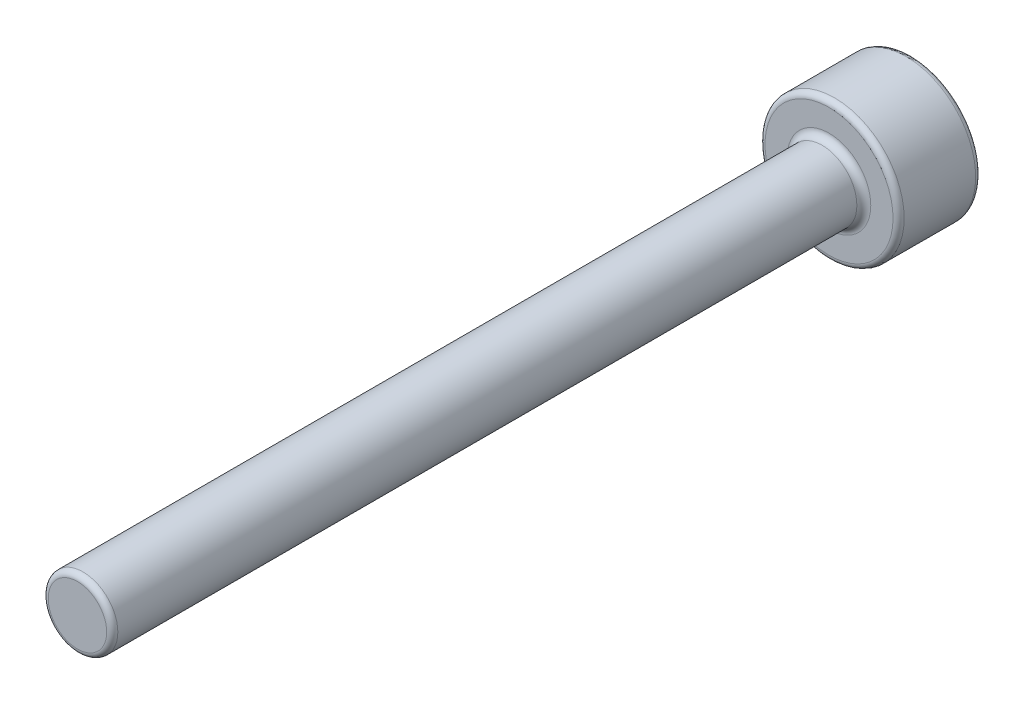
ISO-10303-21;
HEADER;
FILE_DESCRIPTION(('STEP AP214'),'2;1');
FILE_NAME('part.step','',(''),(''),'','','');
FILE_SCHEMA(('AUTOMOTIVE_DESIGN { 1 0 10303 214 1 1 1 1 }'));
ENDSEC;
DATA;
#1=APPLICATION_CONTEXT('core data for automotive mechanical design processes');
#2=APPLICATION_PROTOCOL_DEFINITION('international standard','automotive_design',2000,#1);
#3=PRODUCT_CONTEXT('',#1,'mechanical');
#4=PRODUCT('Part','Part','',(#3));
#5=PRODUCT_RELATED_PRODUCT_CATEGORY('part','',(#4));
#6=PRODUCT_DEFINITION_FORMATION('','',#4);
#7=PRODUCT_DEFINITION_CONTEXT('part definition',#1,'design');
#8=PRODUCT_DEFINITION('design','',#6,#7);
#9=PRODUCT_DEFINITION_SHAPE('','',#8);
#10=(LENGTH_UNIT() NAMED_UNIT(*) SI_UNIT(.MILLI.,.METRE.));
#11=(NAMED_UNIT(*) PLANE_ANGLE_UNIT() SI_UNIT($,.RADIAN.));
#12=(NAMED_UNIT(*) SI_UNIT($,.STERADIAN.) SOLID_ANGLE_UNIT());
#13=UNCERTAINTY_MEASURE_WITH_UNIT(LENGTH_MEASURE(1.E-05),#10,'distance_accuracy_value','');
#14=(GEOMETRIC_REPRESENTATION_CONTEXT(3) GLOBAL_UNCERTAINTY_ASSIGNED_CONTEXT((#13)) GLOBAL_UNIT_ASSIGNED_CONTEXT((#10,
#11,#12)) REPRESENTATION_CONTEXT('',''));
#15=CARTESIAN_POINT('',(0.,0.,0.));
#16=DIRECTION('',(0.,0.,1.));
#17=DIRECTION('',(1.,0.,0.));
#18=AXIS2_PLACEMENT_3D('',#15,#16,#17);
#19=CARTESIAN_POINT('',(0.,0.,6.));
#20=DIRECTION('',(0.,0.,1.));
#21=DIRECTION('',(1.,0.,0.));
#22=AXIS2_PLACEMENT_3D('',#19,#20,#21);
#23=PLANE('',#22);
#24=CARTESIAN_POINT('',(0.,0.,6.));
#25=DIRECTION('',(0.,0.,1.));
#26=DIRECTION('',(1.,0.,0.));
#27=AXIS2_PLACEMENT_3D('',#24,#25,#26);
#28=CIRCLE('',#27,4.6);
#29=CARTESIAN_POINT('',(4.6,0.,6.));
#30=VERTEX_POINT('',#29);
#31=EDGE_CURVE('E182',#30,#30,#28,.T.);
#32=ORIENTED_EDGE('',*,*,#31,.T.);
#33=EDGE_LOOP('',(#32));
#34=FACE_BOUND('',#33,.T.);
#35=CARTESIAN_POINT('',(0.,0.,6.));
#36=DIRECTION('',(0.,0.,1.));
#37=DIRECTION('',(1.,0.,0.));
#38=AXIS2_PLACEMENT_3D('',#35,#36,#37);
#39=CIRCLE('',#38,3.);
#40=CARTESIAN_POINT('',(3.,0.,6.));
#41=VERTEX_POINT('',#40);
#42=EDGE_CURVE('E147',#41,#41,#39,.F.);
#43=ORIENTED_EDGE('',*,*,#42,.T.);
#44=EDGE_LOOP('',(#43));
#45=FACE_BOUND('',#44,.T.);
#46=ADVANCED_FACE('F36',(#34,#45),#23,.T.);
#47=CARTESIAN_POINT('',(0.,0.,6.));
#48=DIRECTION('',(0.,0.,-1.));
#49=DIRECTION('',(-1.,0.,0.));
#50=AXIS2_PLACEMENT_3D('',#47,#48,#49);
#51=CYLINDRICAL_SURFACE('',#50,5.);
#52=CARTESIAN_POINT('',(0.,0.,5.6));
#53=DIRECTION('',(0.,0.,1.));
#54=DIRECTION('',(1.,0.,0.));
#55=AXIS2_PLACEMENT_3D('',#52,#53,#54);
#56=CIRCLE('',#55,5.);
#57=CARTESIAN_POINT('',(5.,0.,5.6));
#58=VERTEX_POINT('',#57);
#59=EDGE_CURVE('E188',#58,#58,#56,.F.);
#60=ORIENTED_EDGE('',*,*,#59,.T.);
#61=EDGE_LOOP('',(#60));
#62=FACE_BOUND('',#61,.T.);
#63=CARTESIAN_POINT('',(0.,0.,0.461880215351701));
#64=DIRECTION('',(0.,0.,-1.));
#65=DIRECTION('',(-1.,0.,0.));
#66=AXIS2_PLACEMENT_3D('',#63,#64,#65);
#67=CIRCLE('',#66,5.);
#68=CARTESIAN_POINT('',(-5.,0.,0.461880215351701));
#69=VERTEX_POINT('',#68);
#70=EDGE_CURVE('E185',#69,#69,#67,.F.);
#71=ORIENTED_EDGE('',*,*,#70,.T.);
#72=EDGE_LOOP('',(#71));
#73=FACE_BOUND('',#72,.T.);
#74=ADVANCED_FACE('F327',(#62,#73),#51,.T.);
#75=CARTESIAN_POINT('',(0.,0.,0.));
#76=DIRECTION('',(0.,0.,1.));
#77=DIRECTION('',(1.,0.,0.));
#78=AXIS2_PLACEMENT_3D('',#75,#76,#77);
#79=PLANE('',#78);
#80=DIRECTION('',(0.866025403784439,-0.5,0.));
#81=VECTOR('',#80,1.);
#82=CARTESIAN_POINT('',(1.45,2.51147367097487,0.));
#83=LINE('',#82,#81);
#84=CARTESIAN_POINT('',(2.9,1.67431578064992,0.));
#85=VERTEX_POINT('',#84);
#86=CARTESIAN_POINT('',(0.,3.34863156129983,0.));
#87=VERTEX_POINT('',#86);
#88=EDGE_CURVE('E53',#85,#87,#83,.F.);
#89=ORIENTED_EDGE('',*,*,#88,.T.);
#90=DIRECTION('',(0.866025403784439,0.5,0.));
#91=VECTOR('',#90,1.);
#92=CARTESIAN_POINT('',(-1.45,2.51147367097487,0.));
#93=LINE('',#92,#91);
#94=CARTESIAN_POINT('',(-2.9,1.67431578064992,0.));
#95=VERTEX_POINT('',#94);
#96=EDGE_CURVE('E208',#87,#95,#93,.F.);
#97=ORIENTED_EDGE('',*,*,#96,.T.);
#98=DIRECTION('',(0.,1.,0.));
#99=VECTOR('',#98,1.);
#100=CARTESIAN_POINT('',(-2.9,0.,0.));
#101=LINE('',#100,#99);
#102=CARTESIAN_POINT('',(-2.9,-1.67431578064992,0.));
#103=VERTEX_POINT('',#102);
#104=EDGE_CURVE('E200',#95,#103,#101,.F.);
#105=ORIENTED_EDGE('',*,*,#104,.T.);
#106=DIRECTION('',(-0.866025403784439,0.5,0.));
#107=VECTOR('',#106,1.);
#108=CARTESIAN_POINT('',(-1.45,-2.51147367097487,0.));
#109=LINE('',#108,#107);
#110=CARTESIAN_POINT('',(0.,-3.34863156129983,0.));
#111=VERTEX_POINT('',#110);
#112=EDGE_CURVE('E202',#103,#111,#109,.F.);
#113=ORIENTED_EDGE('',*,*,#112,.T.);
#114=DIRECTION('',(-0.866025403784439,-0.5,0.));
#115=VECTOR('',#114,1.);
#116=CARTESIAN_POINT('',(1.45,-2.51147367097487,0.));
#117=LINE('',#116,#115);
#118=CARTESIAN_POINT('',(2.9,-1.67431578064991,0.));
#119=VERTEX_POINT('',#118);
#120=EDGE_CURVE('E204',#111,#119,#117,.F.);
#121=ORIENTED_EDGE('',*,*,#120,.T.);
#122=DIRECTION('',(0.,-1.,0.));
#123=VECTOR('',#122,1.);
#124=CARTESIAN_POINT('',(2.9,0.,0.));
#125=LINE('',#124,#123);
#126=EDGE_CURVE('E58',#119,#85,#125,.F.);
#127=ORIENTED_EDGE('',*,*,#126,.T.);
#128=EDGE_LOOP('',(#89,#97,#105,#113,#121,#127));
#129=FACE_BOUND('',#128,.T.);
#130=CARTESIAN_POINT('',(0.,0.,0.));
#131=DIRECTION('',(0.,0.,1.));
#132=DIRECTION('',(1.,0.,0.));
#133=AXIS2_PLACEMENT_3D('',#130,#131,#132);
#134=CIRCLE('',#133,4.49282032302755);
#135=CARTESIAN_POINT('',(4.49282032302755,0.,0.));
#136=VERTEX_POINT('',#135);
#137=EDGE_CURVE('E197',#136,#136,#134,.F.);
#138=ORIENTED_EDGE('',*,*,#137,.T.);
#139=EDGE_LOOP('',(#138));
#140=FACE_BOUND('',#139,.T.);
#141=ADVANCED_FACE('F249',(#129,#140),#79,.F.);
#142=CARTESIAN_POINT('',(0.,0.,60.));
#143=DIRECTION('',(0.,0.,-1.));
#144=DIRECTION('',(-1.,0.,0.));
#145=AXIS2_PLACEMENT_3D('',#142,#143,#144);
#146=CYLINDRICAL_SURFACE('',#145,2.5);
#147=CARTESIAN_POINT('',(0.,0.,59.6));
#148=DIRECTION('',(0.,0.,1.));
#149=DIRECTION('',(1.,0.,0.));
#150=AXIS2_PLACEMENT_3D('',#147,#148,#149);
#151=CIRCLE('',#150,2.5);
#152=CARTESIAN_POINT('',(2.5,0.,59.6));
#153=VERTEX_POINT('',#152);
#154=EDGE_CURVE('E11',#153,#153,#151,.F.);
#155=ORIENTED_EDGE('',*,*,#154,.T.);
#156=EDGE_LOOP('',(#155));
#157=FACE_BOUND('',#156,.T.);
#158=CARTESIAN_POINT('',(0.,0.,6.5));
#159=DIRECTION('',(0.,0.,1.));
#160=DIRECTION('',(1.,0.,0.));
#161=AXIS2_PLACEMENT_3D('',#158,#159,#160);
#162=CIRCLE('',#161,2.5);
#163=CARTESIAN_POINT('',(2.5,0.,6.5));
#164=VERTEX_POINT('',#163);
#165=EDGE_CURVE('E277',#164,#164,#162,.T.);
#166=ORIENTED_EDGE('',*,*,#165,.T.);
#167=EDGE_LOOP('',(#166));
#168=FACE_BOUND('',#167,.T.);
#169=ADVANCED_FACE('F338',(#157,#168),#146,.T.);
#170=CARTESIAN_POINT('',(0.,0.,60.));
#171=DIRECTION('',(0.,0.,1.));
#172=DIRECTION('',(1.,0.,0.));
#173=AXIS2_PLACEMENT_3D('',#170,#171,#172);
#174=PLANE('',#173);
#175=CARTESIAN_POINT('',(0.,0.,60.));
#176=DIRECTION('',(0.,0.,1.));
#177=DIRECTION('',(1.,0.,0.));
#178=AXIS2_PLACEMENT_3D('',#175,#176,#177);
#179=CIRCLE('',#178,2.1);
#180=CARTESIAN_POINT('',(2.1,0.,60.));
#181=VERTEX_POINT('',#180);
#182=EDGE_CURVE('E45',#181,#181,#179,.T.);
#183=ORIENTED_EDGE('',*,*,#182,.T.);
#184=EDGE_LOOP('',(#183));
#185=FACE_BOUND('',#184,.T.);
#186=ADVANCED_FACE('F426',(#185),#174,.T.);
#187=CARTESIAN_POINT('',(0.,-2.88675134594813,3.));
#188=DIRECTION('',(-0.5,-0.866025403784439,0.));
#189=DIRECTION('',(0.866025403784439,-0.5,0.));
#190=AXIS2_PLACEMENT_3D('',#187,#188,#189);
#191=PLANE('',#190);
#192=DIRECTION('',(0.,0.,-1.));
#193=VECTOR('',#192,1.);
#194=CARTESIAN_POINT('',(-2.5,-1.44337567297407,3.));
#195=LINE('',#194,#193);
#196=CARTESIAN_POINT('',(-2.5,-1.44337567297407,2.6));
#197=VERTEX_POINT('',#196);
#198=CARTESIAN_POINT('',(-2.5,-1.44337567297407,0.4));
#199=VERTEX_POINT('',#198);
#200=EDGE_CURVE('E223',#197,#199,#195,.T.);
#201=ORIENTED_EDGE('',*,*,#200,.F.);
#202=DIRECTION('',(-0.866025403784439,0.5,0.));
#203=VECTOR('',#202,1.);
#204=CARTESIAN_POINT('',(0.,-2.88675134594813,2.6));
#205=LINE('',#204,#203);
#206=CARTESIAN_POINT('',(0.,-2.88675134594813,2.6));
#207=VERTEX_POINT('',#206);
#208=EDGE_CURVE('E180',#197,#207,#205,.F.);
#209=ORIENTED_EDGE('',*,*,#208,.T.);
#210=DIRECTION('',(0.,0.,-1.));
#211=VECTOR('',#210,1.);
#212=CARTESIAN_POINT('',(0.,-2.88675134594813,3.));
#213=LINE('',#212,#211);
#214=CARTESIAN_POINT('',(0.,-2.88675134594813,0.4));
#215=VERTEX_POINT('',#214);
#216=EDGE_CURVE('E280',#207,#215,#213,.T.);
#217=ORIENTED_EDGE('',*,*,#216,.T.);
#218=DIRECTION('',(-0.866025403784439,0.5,0.));
#219=VECTOR('',#218,1.);
#220=CARTESIAN_POINT('',(0.,-2.88675134594813,0.4));
#221=LINE('',#220,#219);
#222=EDGE_CURVE('E178',#215,#199,#221,.T.);
#223=ORIENTED_EDGE('',*,*,#222,.T.);
#224=EDGE_LOOP('',(#201,#209,#217,#223));
#225=FACE_BOUND('',#224,.T.);
#226=ADVANCED_FACE('F428',(#225),#191,.F.);
#227=CARTESIAN_POINT('',(2.5,-1.44337567297406,3.));
#228=DIRECTION('',(0.5,-0.866025403784438,0.));
#229=DIRECTION('',(0.866025403784439,0.5,0.));
#230=AXIS2_PLACEMENT_3D('',#227,#228,#229);
#231=PLANE('',#230);
#232=ORIENTED_EDGE('',*,*,#216,.F.);
#233=DIRECTION('',(-0.866025403784439,-0.5,0.));
#234=VECTOR('',#233,1.);
#235=CARTESIAN_POINT('',(2.5,-1.44337567297406,2.6));
#236=LINE('',#235,#234);
#237=CARTESIAN_POINT('',(2.5,-1.44337567297406,2.6));
#238=VERTEX_POINT('',#237);
#239=EDGE_CURVE('E134',#207,#238,#236,.F.);
#240=ORIENTED_EDGE('',*,*,#239,.T.);
#241=DIRECTION('',(0.,0.,-1.));
#242=VECTOR('',#241,1.);
#243=CARTESIAN_POINT('',(2.5,-1.44337567297406,3.));
#244=LINE('',#243,#242);
#245=CARTESIAN_POINT('',(2.5,-1.44337567297406,0.4));
#246=VERTEX_POINT('',#245);
#247=EDGE_CURVE('E303',#238,#246,#244,.T.);
#248=ORIENTED_EDGE('',*,*,#247,.T.);
#249=DIRECTION('',(-0.866025403784439,-0.5,0.));
#250=VECTOR('',#249,1.);
#251=CARTESIAN_POINT('',(2.5,-1.44337567297406,0.4));
#252=LINE('',#251,#250);
#253=EDGE_CURVE('E153',#246,#215,#252,.T.);
#254=ORIENTED_EDGE('',*,*,#253,.T.);
#255=EDGE_LOOP('',(#232,#240,#248,#254));
#256=FACE_BOUND('',#255,.T.);
#257=ADVANCED_FACE('F302',(#256),#231,.F.);
#258=CARTESIAN_POINT('',(2.5,1.44337567297407,3.));
#259=DIRECTION('',(1.,0.,0.));
#260=DIRECTION('',(0.,0.,-1.));
#261=AXIS2_PLACEMENT_3D('',#258,#259,#260);
#262=PLANE('',#261);
#263=ORIENTED_EDGE('',*,*,#247,.F.);
#264=DIRECTION('',(0.,-1.,0.));
#265=VECTOR('',#264,1.);
#266=CARTESIAN_POINT('',(2.5,1.44337567297407,2.6));
#267=LINE('',#266,#265);
#268=CARTESIAN_POINT('',(2.5,1.44337567297407,2.6));
#269=VERTEX_POINT('',#268);
#270=EDGE_CURVE('E163',#238,#269,#267,.F.);
#271=ORIENTED_EDGE('',*,*,#270,.T.);
#272=DIRECTION('',(0.,0.,-1.));
#273=VECTOR('',#272,1.);
#274=CARTESIAN_POINT('',(2.5,1.44337567297407,3.));
#275=LINE('',#274,#273);
#276=CARTESIAN_POINT('',(2.5,1.44337567297407,0.4));
#277=VERTEX_POINT('',#276);
#278=EDGE_CURVE('E272',#269,#277,#275,.T.);
#279=ORIENTED_EDGE('',*,*,#278,.T.);
#280=DIRECTION('',(0.,-1.,0.));
#281=VECTOR('',#280,1.);
#282=CARTESIAN_POINT('',(2.5,1.44337567297407,0.4));
#283=LINE('',#282,#281);
#284=EDGE_CURVE('E161',#277,#246,#283,.T.);
#285=ORIENTED_EDGE('',*,*,#284,.T.);
#286=EDGE_LOOP('',(#263,#271,#279,#285));
#287=FACE_BOUND('',#286,.T.);
#288=ADVANCED_FACE('F305',(#287),#262,.F.);
#289=CARTESIAN_POINT('',(0.,2.88675134594813,3.));
#290=DIRECTION('',(0.5,0.866025403784439,0.));
#291=DIRECTION('',(-0.866025403784439,0.5,0.));
#292=AXIS2_PLACEMENT_3D('',#289,#290,#291);
#293=PLANE('',#292);
#294=ORIENTED_EDGE('',*,*,#278,.F.);
#295=DIRECTION('',(0.866025403784439,-0.5,0.));
#296=VECTOR('',#295,1.);
#297=CARTESIAN_POINT('',(0.,2.88675134594813,2.6));
#298=LINE('',#297,#296);
#299=CARTESIAN_POINT('',(0.,2.88675134594813,2.6));
#300=VERTEX_POINT('',#299);
#301=EDGE_CURVE('E167',#269,#300,#298,.F.);
#302=ORIENTED_EDGE('',*,*,#301,.T.);
#303=DIRECTION('',(0.,0.,-1.));
#304=VECTOR('',#303,1.);
#305=CARTESIAN_POINT('',(0.,2.88675134594813,3.));
#306=LINE('',#305,#304);
#307=CARTESIAN_POINT('',(0.,2.88675134594813,0.4));
#308=VERTEX_POINT('',#307);
#309=EDGE_CURVE('E270',#300,#308,#306,.T.);
#310=ORIENTED_EDGE('',*,*,#309,.T.);
#311=DIRECTION('',(0.866025403784439,-0.5,0.));
#312=VECTOR('',#311,1.);
#313=CARTESIAN_POINT('',(0.,2.88675134594813,0.4));
#314=LINE('',#313,#312);
#315=EDGE_CURVE('E165',#308,#277,#314,.T.);
#316=ORIENTED_EDGE('',*,*,#315,.T.);
#317=EDGE_LOOP('',(#294,#302,#310,#316));
#318=FACE_BOUND('',#317,.T.);
#319=ADVANCED_FACE('F441',(#318),#293,.F.);
#320=CARTESIAN_POINT('',(-2.5,1.44337567297407,3.));
#321=DIRECTION('',(-0.5,0.866025403784439,0.));
#322=DIRECTION('',(-0.866025403784439,-0.5,0.));
#323=AXIS2_PLACEMENT_3D('',#320,#321,#322);
#324=PLANE('',#323);
#325=ORIENTED_EDGE('',*,*,#309,.F.);
#326=DIRECTION('',(0.866025403784439,0.5,0.));
#327=VECTOR('',#326,1.);
#328=CARTESIAN_POINT('',(-2.5,1.44337567297407,2.6));
#329=LINE('',#328,#327);
#330=CARTESIAN_POINT('',(-2.5,1.44337567297407,2.6));
#331=VERTEX_POINT('',#330);
#332=EDGE_CURVE('E172',#300,#331,#329,.F.);
#333=ORIENTED_EDGE('',*,*,#332,.T.);
#334=DIRECTION('',(0.,0.,-1.));
#335=VECTOR('',#334,1.);
#336=CARTESIAN_POINT('',(-2.5,1.44337567297407,3.));
#337=LINE('',#336,#335);
#338=CARTESIAN_POINT('',(-2.5,1.44337567297407,0.4));
#339=VERTEX_POINT('',#338);
#340=EDGE_CURVE('E262',#331,#339,#337,.T.);
#341=ORIENTED_EDGE('',*,*,#340,.T.);
#342=DIRECTION('',(0.866025403784439,0.5,0.));
#343=VECTOR('',#342,1.);
#344=CARTESIAN_POINT('',(-2.5,1.44337567297407,0.4));
#345=LINE('',#344,#343);
#346=EDGE_CURVE('E169',#339,#308,#345,.T.);
#347=ORIENTED_EDGE('',*,*,#346,.T.);
#348=EDGE_LOOP('',(#325,#333,#341,#347));
#349=FACE_BOUND('',#348,.T.);
#350=ADVANCED_FACE('F267',(#349),#324,.F.);
#351=CARTESIAN_POINT('',(-2.5,-1.44337567297407,3.));
#352=DIRECTION('',(-1.,0.,0.));
#353=DIRECTION('',(0.,0.,1.));
#354=AXIS2_PLACEMENT_3D('',#351,#352,#353);
#355=PLANE('',#354);
#356=ORIENTED_EDGE('',*,*,#340,.F.);
#357=DIRECTION('',(0.,1.,0.));
#358=VECTOR('',#357,1.);
#359=CARTESIAN_POINT('',(-2.5,-1.44337567297407,2.6));
#360=LINE('',#359,#358);
#361=EDGE_CURVE('E176',#331,#197,#360,.F.);
#362=ORIENTED_EDGE('',*,*,#361,.T.);
#363=ORIENTED_EDGE('',*,*,#200,.T.);
#364=DIRECTION('',(0.,1.,0.));
#365=VECTOR('',#364,1.);
#366=CARTESIAN_POINT('',(-2.5,-1.44337567297407,0.4));
#367=LINE('',#366,#365);
#368=EDGE_CURVE('E174',#199,#339,#367,.T.);
#369=ORIENTED_EDGE('',*,*,#368,.T.);
#370=EDGE_LOOP('',(#356,#362,#363,#369));
#371=FACE_BOUND('',#370,.T.);
#372=ADVANCED_FACE('F261',(#371),#355,.F.);
#373=CARTESIAN_POINT('',(-2.5,-1.44337567297407,3.));
#374=DIRECTION('',(0.,0.,-1.));
#375=DIRECTION('',(-1.,0.,0.));
#376=AXIS2_PLACEMENT_3D('',#373,#374,#375);
#377=PLANE('',#376);
#378=DIRECTION('',(0.,-1.,0.));
#379=VECTOR('',#378,1.);
#380=CARTESIAN_POINT('',(2.1,-1.44337567297407,3.));
#381=LINE('',#380,#379);
#382=CARTESIAN_POINT('',(2.1,1.21243556529822,3.));
#383=VERTEX_POINT('',#382);
#384=CARTESIAN_POINT('',(2.1,-1.21243556529821,3.));
#385=VERTEX_POINT('',#384);
#386=EDGE_CURVE('E151',#383,#385,#381,.T.);
#387=ORIENTED_EDGE('',*,*,#386,.T.);
#388=DIRECTION('',(-0.866025403784439,-0.5,0.));
#389=VECTOR('',#388,1.);
#390=CARTESIAN_POINT('',(-1.45,-3.26202902092139,3.));
#391=LINE('',#390,#389);
#392=CARTESIAN_POINT('',(0.,-2.42487113059643,3.));
#393=VERTEX_POINT('',#392);
#394=EDGE_CURVE('E132',#385,#393,#391,.T.);
#395=ORIENTED_EDGE('',*,*,#394,.T.);
#396=DIRECTION('',(-0.866025403784439,0.5,0.));
#397=VECTOR('',#396,1.);
#398=CARTESIAN_POINT('',(-2.3,-1.09696551146029,3.));
#399=LINE('',#398,#397);
#400=CARTESIAN_POINT('',(-2.1,-1.21243556529822,3.));
#401=VERTEX_POINT('',#400);
#402=EDGE_CURVE('E140',#393,#401,#399,.T.);
#403=ORIENTED_EDGE('',*,*,#402,.T.);
#404=DIRECTION('',(0.,1.,0.));
#405=VECTOR('',#404,1.);
#406=CARTESIAN_POINT('',(-2.1,-1.44337567297407,3.));
#407=LINE('',#406,#405);
#408=CARTESIAN_POINT('',(-2.1,1.21243556529822,3.));
#409=VERTEX_POINT('',#408);
#410=EDGE_CURVE('E146',#401,#409,#407,.T.);
#411=ORIENTED_EDGE('',*,*,#410,.T.);
#412=DIRECTION('',(0.866025403784439,0.5,0.));
#413=VECTOR('',#412,1.);
#414=CARTESIAN_POINT('',(-3.55,0.375277674973258,3.));
#415=LINE('',#414,#413);
#416=CARTESIAN_POINT('',(0.,2.42487113059643,3.));
#417=VERTEX_POINT('',#416);
#418=EDGE_CURVE('E284',#409,#417,#415,.T.);
#419=ORIENTED_EDGE('',*,*,#418,.T.);
#420=DIRECTION('',(0.866025403784439,-0.5,0.));
#421=VECTOR('',#420,1.);
#422=CARTESIAN_POINT('',(-0.199999999999999,2.54034118443435,3.));
#423=LINE('',#422,#421);
#424=EDGE_CURVE('E156',#417,#383,#423,.T.);
#425=ORIENTED_EDGE('',*,*,#424,.T.);
#426=EDGE_LOOP('',(#387,#395,#403,#411,#419,#425));
#427=FACE_BOUND('',#426,.T.);
#428=ADVANCED_FACE('F149',(#427),#377,.T.);
#429=CARTESIAN_POINT('',(0.,0.,0.23094010767585));
#430=DIRECTION('',(0.,0.,1.));
#431=DIRECTION('',(1.,0.,0.));
#432=AXIS2_PLACEMENT_3D('',#429,#430,#431);
#433=CONICAL_SURFACE('',#432,5.,1.0471975511966);
#434=CARTESIAN_POINT('',(0.,0.,0.115470053837925));
#435=DIRECTION('',(0.,0.,1.));
#436=DIRECTION('',(1.,0.,0.));
#437=AXIS2_PLACEMENT_3D('',#434,#435,#436);
#438=CIRCLE('',#437,4.8);
#439=CARTESIAN_POINT('',(4.8,0.,0.115470053837925));
#440=VERTEX_POINT('',#439);
#441=EDGE_CURVE('E194',#440,#440,#438,.F.);
#442=ORIENTED_EDGE('',*,*,#441,.T.);
#443=EDGE_LOOP('',(#442));
#444=FACE_BOUND('',#443,.T.);
#445=CARTESIAN_POINT('',(0.,0.,0.0535898384862229));
#446=DIRECTION('',(0.,0.,1.));
#447=DIRECTION('',(1.,0.,0.));
#448=AXIS2_PLACEMENT_3D('',#445,#446,#447);
#449=CIRCLE('',#448,4.69282032302755);
#450=CARTESIAN_POINT('',(4.69282032302755,0.,0.0535898384862229));
#451=VERTEX_POINT('',#450);
#452=EDGE_CURVE('E191',#451,#451,#449,.T.);
#453=ORIENTED_EDGE('',*,*,#452,.T.);
#454=EDGE_LOOP('',(#453));
#455=FACE_BOUND('',#454,.T.);
#456=ADVANCED_FACE('F342',(#444,#455),#433,.T.);
#457=CARTESIAN_POINT('',(0.,0.,6.5));
#458=DIRECTION('',(0.,0.,1.));
#459=DIRECTION('',(1.,0.,0.));
#460=AXIS2_PLACEMENT_3D('',#457,#458,#459);
#461=TOROIDAL_SURFACE('',#460,3.,0.5);
#462=ORIENTED_EDGE('',*,*,#42,.F.);
#463=EDGE_LOOP('',(#462));
#464=FACE_BOUND('',#463,.T.);
#465=ORIENTED_EDGE('',*,*,#165,.F.);
#466=EDGE_LOOP('',(#465));
#467=FACE_BOUND('',#466,.T.);
#468=ADVANCED_FACE('F345',(#464,#467),#461,.F.);
#469=CARTESIAN_POINT('',(-3.55,0.375277674973258,2.6));
#470=DIRECTION('',(0.866025403784439,0.5,0.));
#471=DIRECTION('',(-0.5,0.866025403784439,0.));
#472=AXIS2_PLACEMENT_3D('',#469,#470,#471);
#473=CYLINDRICAL_SURFACE('',#472,0.4);
#474=CARTESIAN_POINT('',(-2.1,1.21243556529822,2.6));
#475=DIRECTION('',(0.5,0.866025403784439,0.));
#476=DIRECTION('',(0.866025403784439,-0.5,0.));
#477=AXIS2_PLACEMENT_3D('',#474,#475,#476);
#478=ELLIPSE('',#477,0.461880215351701,0.4);
#479=EDGE_CURVE('E217',#331,#409,#478,.T.);
#480=ORIENTED_EDGE('',*,*,#479,.F.);
#481=ORIENTED_EDGE('',*,*,#332,.F.);
#482=CARTESIAN_POINT('',(0.,2.42487113059643,2.6));
#483=DIRECTION('',(1.,0.,0.));
#484=DIRECTION('',(0.,-1.,0.));
#485=AXIS2_PLACEMENT_3D('',#482,#483,#484);
#486=ELLIPSE('',#485,0.461880215351701,0.4);
#487=EDGE_CURVE('E220',#417,#300,#486,.F.);
#488=ORIENTED_EDGE('',*,*,#487,.F.);
#489=ORIENTED_EDGE('',*,*,#418,.F.);
#490=EDGE_LOOP('',(#480,#481,#488,#489));
#491=FACE_BOUND('',#490,.T.);
#492=ADVANCED_FACE('F349',(#491),#473,.F.);
#493=CARTESIAN_POINT('',(-0.199999999999999,2.54034118443435,2.6));
#494=DIRECTION('',(0.866025403784439,-0.5,0.));
#495=DIRECTION('',(0.5,0.866025403784439,0.));
#496=AXIS2_PLACEMENT_3D('',#493,#494,#495);
#497=CYLINDRICAL_SURFACE('',#496,0.4);
#498=ORIENTED_EDGE('',*,*,#487,.T.);
#499=ORIENTED_EDGE('',*,*,#301,.F.);
#500=CARTESIAN_POINT('',(2.1,1.21243556529821,2.6));
#501=DIRECTION('',(0.5,-0.866025403784439,0.));
#502=DIRECTION('',(-0.866025403784439,-0.5,0.));
#503=AXIS2_PLACEMENT_3D('',#500,#501,#502);
#504=ELLIPSE('',#503,0.461880215351701,0.4);
#505=EDGE_CURVE('E214',#383,#269,#504,.F.);
#506=ORIENTED_EDGE('',*,*,#505,.F.);
#507=ORIENTED_EDGE('',*,*,#424,.F.);
#508=EDGE_LOOP('',(#498,#499,#506,#507));
#509=FACE_BOUND('',#508,.T.);
#510=ADVANCED_FACE('F291',(#509),#497,.F.);
#511=CARTESIAN_POINT('',(-2.1,-1.44337567297407,2.6));
#512=DIRECTION('',(0.,1.,0.));
#513=DIRECTION('',(0.,0.,1.));
#514=AXIS2_PLACEMENT_3D('',#511,#512,#513);
#515=CYLINDRICAL_SURFACE('',#514,0.4);
#516=ORIENTED_EDGE('',*,*,#479,.T.);
#517=ORIENTED_EDGE('',*,*,#410,.F.);
#518=CARTESIAN_POINT('',(-2.1,-1.21243556529822,2.6));
#519=DIRECTION('',(-0.5,0.866025403784439,0.));
#520=DIRECTION('',(0.866025403784439,0.5,0.));
#521=AXIS2_PLACEMENT_3D('',#518,#519,#520);
#522=ELLIPSE('',#521,0.461880215351701,0.4);
#523=EDGE_CURVE('E143',#197,#401,#522,.T.);
#524=ORIENTED_EDGE('',*,*,#523,.F.);
#525=ORIENTED_EDGE('',*,*,#361,.F.);
#526=EDGE_LOOP('',(#516,#517,#524,#525));
#527=FACE_BOUND('',#526,.T.);
#528=ADVANCED_FACE('F358',(#527),#515,.F.);
#529=CARTESIAN_POINT('',(2.1,-1.44337567297407,2.6));
#530=DIRECTION('',(0.,-1.,0.));
#531=DIRECTION('',(0.,0.,-1.));
#532=AXIS2_PLACEMENT_3D('',#529,#530,#531);
#533=CYLINDRICAL_SURFACE('',#532,0.4);
#534=ORIENTED_EDGE('',*,*,#505,.T.);
#535=ORIENTED_EDGE('',*,*,#270,.F.);
#536=CARTESIAN_POINT('',(2.1,-1.21243556529821,2.6));
#537=DIRECTION('',(-0.5,-0.866025403784439,0.));
#538=DIRECTION('',(-0.866025403784439,0.5,0.));
#539=AXIS2_PLACEMENT_3D('',#536,#537,#538);
#540=ELLIPSE('',#539,0.461880215351701,0.4);
#541=EDGE_CURVE('E137',#385,#238,#540,.F.);
#542=ORIENTED_EDGE('',*,*,#541,.F.);
#543=ORIENTED_EDGE('',*,*,#386,.F.);
#544=EDGE_LOOP('',(#534,#535,#542,#543));
#545=FACE_BOUND('',#544,.T.);
#546=ADVANCED_FACE('F294',(#545),#533,.F.);
#547=CARTESIAN_POINT('',(-2.3,-1.09696551146029,2.6));
#548=DIRECTION('',(-0.866025403784439,0.5,0.));
#549=DIRECTION('',(-0.5,-0.866025403784439,0.));
#550=AXIS2_PLACEMENT_3D('',#547,#548,#549);
#551=CYLINDRICAL_SURFACE('',#550,0.4);
#552=ORIENTED_EDGE('',*,*,#523,.T.);
#553=ORIENTED_EDGE('',*,*,#402,.F.);
#554=CARTESIAN_POINT('',(0.,-2.42487113059643,2.6));
#555=DIRECTION('',(-1.,0.,0.));
#556=DIRECTION('',(0.,-1.,0.));
#557=AXIS2_PLACEMENT_3D('',#554,#555,#556);
#558=ELLIPSE('',#557,0.461880215351701,0.4);
#559=EDGE_CURVE('E128',#207,#393,#558,.T.);
#560=ORIENTED_EDGE('',*,*,#559,.F.);
#561=ORIENTED_EDGE('',*,*,#208,.F.);
#562=EDGE_LOOP('',(#552,#553,#560,#561));
#563=FACE_BOUND('',#562,.T.);
#564=ADVANCED_FACE('F141',(#563),#551,.F.);
#565=CARTESIAN_POINT('',(-1.45,-3.26202902092139,2.6));
#566=DIRECTION('',(-0.866025403784439,-0.5,0.));
#567=DIRECTION('',(0.5,-0.866025403784439,0.));
#568=AXIS2_PLACEMENT_3D('',#565,#566,#567);
#569=CYLINDRICAL_SURFACE('',#568,0.4);
#570=ORIENTED_EDGE('',*,*,#541,.T.);
#571=ORIENTED_EDGE('',*,*,#239,.F.);
#572=ORIENTED_EDGE('',*,*,#559,.T.);
#573=ORIENTED_EDGE('',*,*,#394,.F.);
#574=EDGE_LOOP('',(#570,#571,#572,#573));
#575=FACE_BOUND('',#574,.T.);
#576=ADVANCED_FACE('F130',(#575),#569,.F.);
#577=CARTESIAN_POINT('',(0.,0.,5.6));
#578=DIRECTION('',(0.,0.,1.));
#579=DIRECTION('',(1.,0.,0.));
#580=AXIS2_PLACEMENT_3D('',#577,#578,#579);
#581=TOROIDAL_SURFACE('',#580,4.6,0.4);
#582=ORIENTED_EDGE('',*,*,#59,.F.);
#583=EDGE_LOOP('',(#582));
#584=FACE_BOUND('',#583,.T.);
#585=ORIENTED_EDGE('',*,*,#31,.F.);
#586=EDGE_LOOP('',(#585));
#587=FACE_BOUND('',#586,.T.);
#588=ADVANCED_FACE('F353',(#584,#587),#581,.T.);
#589=CARTESIAN_POINT('',(0.,0.,0.461880215351701));
#590=DIRECTION('',(0.,0.,-1.));
#591=DIRECTION('',(-1.,0.,0.));
#592=AXIS2_PLACEMENT_3D('',#589,#590,#591);
#593=TOROIDAL_SURFACE('',#592,4.6,0.4);
#594=ORIENTED_EDGE('',*,*,#441,.F.);
#595=EDGE_LOOP('',(#594));
#596=FACE_BOUND('',#595,.T.);
#597=ORIENTED_EDGE('',*,*,#70,.F.);
#598=EDGE_LOOP('',(#597));
#599=FACE_BOUND('',#598,.T.);
#600=ADVANCED_FACE('F368',(#596,#599),#593,.T.);
#601=CARTESIAN_POINT('',(2.7,-1.78978583448784,0.4));
#602=DIRECTION('',(-0.866025403784439,-0.5,0.));
#603=DIRECTION('',(0.5,-0.866025403784439,0.));
#604=AXIS2_PLACEMENT_3D('',#601,#602,#603);
#605=CYLINDRICAL_SURFACE('',#604,0.4);
#606=CARTESIAN_POINT('',(2.9,-1.67431578064991,0.4));
#607=DIRECTION('',(-0.5,-0.866025403784439,0.));
#608=DIRECTION('',(0.866025403784439,-0.5,0.));
#609=AXIS2_PLACEMENT_3D('',#606,#607,#608);
#610=ELLIPSE('',#609,0.461880215351701,0.4);
#611=EDGE_CURVE('E233',#119,#246,#610,.F.);
#612=ORIENTED_EDGE('',*,*,#611,.F.);
#613=ORIENTED_EDGE('',*,*,#120,.F.);
#614=CARTESIAN_POINT('',(0.,-3.34863156129983,0.4));
#615=DIRECTION('',(-1.,0.,0.));
#616=DIRECTION('',(0.,-1.,0.));
#617=AXIS2_PLACEMENT_3D('',#614,#615,#616);
#618=ELLIPSE('',#617,0.461880215351701,0.4);
#619=EDGE_CURVE('E40',#215,#111,#618,.T.);
#620=ORIENTED_EDGE('',*,*,#619,.F.);
#621=ORIENTED_EDGE('',*,*,#253,.F.);
#622=EDGE_LOOP('',(#612,#613,#620,#621));
#623=FACE_BOUND('',#622,.T.);
#624=ADVANCED_FACE('F248',(#623),#605,.T.);
#625=CARTESIAN_POINT('',(-0.2,-3.2331615074619,0.4));
#626=DIRECTION('',(-0.866025403784439,0.5,0.));
#627=DIRECTION('',(-0.5,-0.866025403784439,0.));
#628=AXIS2_PLACEMENT_3D('',#625,#626,#627);
#629=CYLINDRICAL_SURFACE('',#628,0.4);
#630=ORIENTED_EDGE('',*,*,#619,.T.);
#631=ORIENTED_EDGE('',*,*,#112,.F.);
#632=CARTESIAN_POINT('',(-2.9,-1.67431578064992,0.4));
#633=DIRECTION('',(-0.5,0.866025403784439,0.));
#634=DIRECTION('',(-0.866025403784439,-0.5,0.));
#635=AXIS2_PLACEMENT_3D('',#632,#633,#634);
#636=ELLIPSE('',#635,0.461880215351701,0.4);
#637=EDGE_CURVE('E231',#199,#103,#636,.T.);
#638=ORIENTED_EDGE('',*,*,#637,.F.);
#639=ORIENTED_EDGE('',*,*,#222,.F.);
#640=EDGE_LOOP('',(#630,#631,#638,#639));
#641=FACE_BOUND('',#640,.T.);
#642=ADVANCED_FACE('F243',(#641),#629,.T.);
#643=CARTESIAN_POINT('',(2.9,1.44337567297407,0.4));
#644=DIRECTION('',(0.,-1.,0.));
#645=DIRECTION('',(0.,0.,-1.));
#646=AXIS2_PLACEMENT_3D('',#643,#644,#645);
#647=CYLINDRICAL_SURFACE('',#646,0.4);
#648=ORIENTED_EDGE('',*,*,#611,.T.);
#649=ORIENTED_EDGE('',*,*,#284,.F.);
#650=CARTESIAN_POINT('',(2.9,1.67431578064992,0.4));
#651=DIRECTION('',(0.5,-0.866025403784439,0.));
#652=DIRECTION('',(0.866025403784439,0.5,0.));
#653=AXIS2_PLACEMENT_3D('',#650,#651,#652);
#654=ELLIPSE('',#653,0.461880215351701,0.4);
#655=EDGE_CURVE('E228',#85,#277,#654,.F.);
#656=ORIENTED_EDGE('',*,*,#655,.F.);
#657=ORIENTED_EDGE('',*,*,#126,.F.);
#658=EDGE_LOOP('',(#648,#649,#656,#657));
#659=FACE_BOUND('',#658,.T.);
#660=ADVANCED_FACE('F309',(#659),#647,.T.);
#661=CARTESIAN_POINT('',(-2.9,-1.44337567297407,0.4));
#662=DIRECTION('',(0.,1.,0.));
#663=DIRECTION('',(0.,0.,1.));
#664=AXIS2_PLACEMENT_3D('',#661,#662,#663);
#665=CYLINDRICAL_SURFACE('',#664,0.4);
#666=ORIENTED_EDGE('',*,*,#637,.T.);
#667=ORIENTED_EDGE('',*,*,#104,.F.);
#668=CARTESIAN_POINT('',(-2.9,1.67431578064992,0.4));
#669=DIRECTION('',(0.5,0.866025403784439,0.));
#670=DIRECTION('',(0.866025403784439,-0.5,0.));
#671=AXIS2_PLACEMENT_3D('',#668,#669,#670);
#672=ELLIPSE('',#671,0.461880215351701,0.4);
#673=EDGE_CURVE('E226',#339,#95,#672,.T.);
#674=ORIENTED_EDGE('',*,*,#673,.F.);
#675=ORIENTED_EDGE('',*,*,#368,.F.);
#676=EDGE_LOOP('',(#666,#667,#674,#675));
#677=FACE_BOUND('',#676,.T.);
#678=ADVANCED_FACE('F254',(#677),#665,.T.);
#679=CARTESIAN_POINT('',(0.2,3.2331615074619,0.4));
#680=DIRECTION('',(0.866025403784439,-0.5,0.));
#681=DIRECTION('',(0.5,0.866025403784439,0.));
#682=AXIS2_PLACEMENT_3D('',#679,#680,#681);
#683=CYLINDRICAL_SURFACE('',#682,0.4);
#684=ORIENTED_EDGE('',*,*,#655,.T.);
#685=ORIENTED_EDGE('',*,*,#315,.F.);
#686=CARTESIAN_POINT('',(0.,3.34863156129983,0.4));
#687=DIRECTION('',(1.,0.,0.));
#688=DIRECTION('',(0.,1.,0.));
#689=AXIS2_PLACEMENT_3D('',#686,#687,#688);
#690=ELLIPSE('',#689,0.461880215351701,0.4);
#691=EDGE_CURVE('E224',#87,#308,#690,.F.);
#692=ORIENTED_EDGE('',*,*,#691,.F.);
#693=ORIENTED_EDGE('',*,*,#88,.F.);
#694=EDGE_LOOP('',(#684,#685,#692,#693));
#695=FACE_BOUND('',#694,.T.);
#696=ADVANCED_FACE('F312',(#695),#683,.T.);
#697=CARTESIAN_POINT('',(-2.7,1.78978583448784,0.4));
#698=DIRECTION('',(0.866025403784439,0.5,0.));
#699=DIRECTION('',(-0.5,0.866025403784439,0.));
#700=AXIS2_PLACEMENT_3D('',#697,#698,#699);
#701=CYLINDRICAL_SURFACE('',#700,0.4);
#702=ORIENTED_EDGE('',*,*,#673,.T.);
#703=ORIENTED_EDGE('',*,*,#96,.F.);
#704=ORIENTED_EDGE('',*,*,#691,.T.);
#705=ORIENTED_EDGE('',*,*,#346,.F.);
#706=EDGE_LOOP('',(#702,#703,#704,#705));
#707=FACE_BOUND('',#706,.T.);
#708=ADVANCED_FACE('F315',(#707),#701,.T.);
#709=CARTESIAN_POINT('',(0.,0.,0.4));
#710=DIRECTION('',(0.,0.,1.));
#711=DIRECTION('',(1.,0.,0.));
#712=AXIS2_PLACEMENT_3D('',#709,#710,#711);
#713=TOROIDAL_SURFACE('',#712,4.49282032302755,0.4);
#714=ORIENTED_EDGE('',*,*,#452,.F.);
#715=EDGE_LOOP('',(#714));
#716=FACE_BOUND('',#715,.T.);
#717=ORIENTED_EDGE('',*,*,#137,.F.);
#718=EDGE_LOOP('',(#717));
#719=FACE_BOUND('',#718,.T.);
#720=ADVANCED_FACE('F317',(#716,#719),#713,.T.);
#721=CARTESIAN_POINT('',(0.,0.,59.6));
#722=DIRECTION('',(0.,0.,1.));
#723=DIRECTION('',(1.,0.,0.));
#724=AXIS2_PLACEMENT_3D('',#721,#722,#723);
#725=TOROIDAL_SURFACE('',#724,2.1,0.4);
#726=ORIENTED_EDGE('',*,*,#154,.F.);
#727=EDGE_LOOP('',(#726));
#728=FACE_BOUND('',#727,.T.);
#729=ORIENTED_EDGE('',*,*,#182,.F.);
#730=EDGE_LOOP('',(#729));
#731=FACE_BOUND('',#730,.T.);
#732=ADVANCED_FACE('F38',(#728,#731),#725,.T.);
#733=CLOSED_SHELL('',(#46,#74,#141,#169,#186,#226,#257,#288,#319,#350,#372,#428,#456,#468,#492,
#510,#528,#546,#564,#576,#588,#600,#624,#642,#660,#678,#696,#708,#720,#732));
#734=MANIFOLD_SOLID_BREP('B2',#733);
#735=ADVANCED_BREP_SHAPE_REPRESENTATION('',(#18,#734),#14);
#736=SHAPE_DEFINITION_REPRESENTATION(#9,#735);
ENDSEC;
END-ISO-10303-21;
